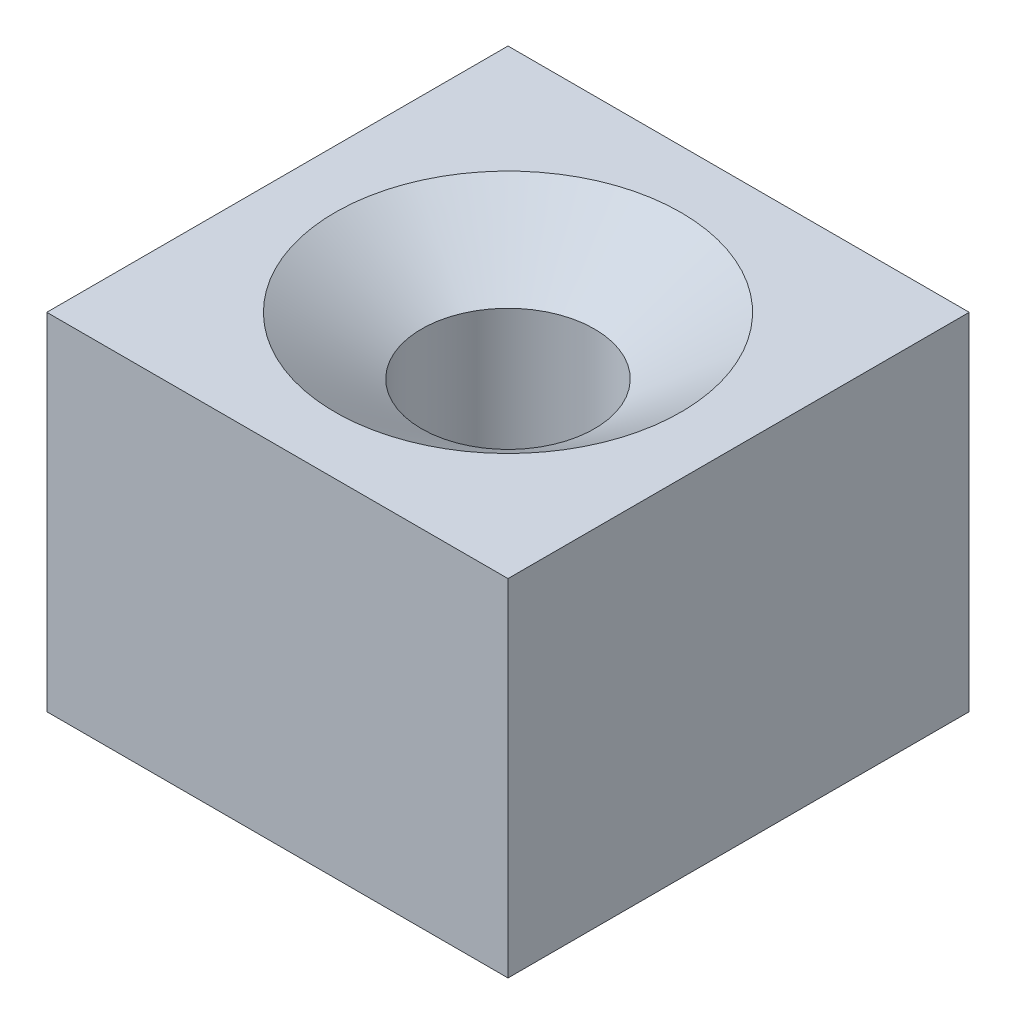
ISO-10303-21;
HEADER;
FILE_DESCRIPTION(('STEP AP214'),'2;1');
FILE_NAME('part.step','',(''),(''),'','','');
FILE_SCHEMA(('AUTOMOTIVE_DESIGN { 1 0 10303 214 1 1 1 1 }'));
ENDSEC;
DATA;
#1=APPLICATION_CONTEXT('core data for automotive mechanical design processes');
#2=APPLICATION_PROTOCOL_DEFINITION('international standard','automotive_design',2000,#1);
#3=PRODUCT_CONTEXT('',#1,'mechanical');
#4=PRODUCT('Part','Part','',(#3));
#5=PRODUCT_RELATED_PRODUCT_CATEGORY('part','',(#4));
#6=PRODUCT_DEFINITION_FORMATION('','',#4);
#7=PRODUCT_DEFINITION_CONTEXT('part definition',#1,'design');
#8=PRODUCT_DEFINITION('design','',#6,#7);
#9=PRODUCT_DEFINITION_SHAPE('','',#8);
#10=(LENGTH_UNIT() NAMED_UNIT(*) SI_UNIT(.MILLI.,.METRE.));
#11=(NAMED_UNIT(*) PLANE_ANGLE_UNIT() SI_UNIT($,.RADIAN.));
#12=(NAMED_UNIT(*) SI_UNIT($,.STERADIAN.) SOLID_ANGLE_UNIT());
#13=UNCERTAINTY_MEASURE_WITH_UNIT(LENGTH_MEASURE(1.E-05),#10,'distance_accuracy_value','');
#14=(GEOMETRIC_REPRESENTATION_CONTEXT(3) GLOBAL_UNCERTAINTY_ASSIGNED_CONTEXT((#13)) GLOBAL_UNIT_ASSIGNED_CONTEXT((#10,
#11,#12)) REPRESENTATION_CONTEXT('',''));
#15=CARTESIAN_POINT('',(0.,0.,0.));
#16=DIRECTION('',(0.,0.,1.));
#17=DIRECTION('',(1.,0.,0.));
#18=AXIS2_PLACEMENT_3D('',#15,#16,#17);
#19=CARTESIAN_POINT('',(40.,60.,40.));
#20=DIRECTION('',(-1.,0.,0.));
#21=DIRECTION('',(0.,0.,1.));
#22=AXIS2_PLACEMENT_3D('',#19,#20,#21);
#23=PLANE('',#22);
#24=DIRECTION('',(0.,0.,-1.));
#25=VECTOR('',#24,1.);
#26=CARTESIAN_POINT('',(40.,0.,40.));
#27=LINE('',#26,#25);
#28=CARTESIAN_POINT('',(40.,0.,40.));
#29=VERTEX_POINT('',#28);
#30=CARTESIAN_POINT('',(40.,0.,-40.));
#31=VERTEX_POINT('',#30);
#32=EDGE_CURVE('E96',#29,#31,#27,.T.);
#33=ORIENTED_EDGE('',*,*,#32,.T.);
#34=DIRECTION('',(0.,-1.,0.));
#35=VECTOR('',#34,1.);
#36=CARTESIAN_POINT('',(40.,60.,-40.));
#37=LINE('',#36,#35);
#38=CARTESIAN_POINT('',(40.,60.,-40.));
#39=VERTEX_POINT('',#38);
#40=EDGE_CURVE('E11',#39,#31,#37,.T.);
#41=ORIENTED_EDGE('',*,*,#40,.F.);
#42=DIRECTION('',(0.,0.,-1.));
#43=VECTOR('',#42,1.);
#44=CARTESIAN_POINT('',(40.,60.,40.));
#45=LINE('',#44,#43);
#46=CARTESIAN_POINT('',(40.,60.,40.));
#47=VERTEX_POINT('',#46);
#48=EDGE_CURVE('E84',#47,#39,#45,.T.);
#49=ORIENTED_EDGE('',*,*,#48,.F.);
#50=DIRECTION('',(0.,-1.,0.));
#51=VECTOR('',#50,1.);
#52=CARTESIAN_POINT('',(40.,60.,40.));
#53=LINE('',#52,#51);
#54=EDGE_CURVE('E92',#47,#29,#53,.T.);
#55=ORIENTED_EDGE('',*,*,#54,.T.);
#56=EDGE_LOOP('',(#33,#41,#49,#55));
#57=FACE_BOUND('',#56,.T.);
#58=ADVANCED_FACE('F33',(#57),#23,.F.);
#59=CARTESIAN_POINT('',(-40.,60.,-40.));
#60=DIRECTION('',(0.,0.,1.));
#61=DIRECTION('',(1.,0.,0.));
#62=AXIS2_PLACEMENT_3D('',#59,#60,#61);
#63=PLANE('',#62);
#64=DIRECTION('',(-1.,0.,0.));
#65=VECTOR('',#64,1.);
#66=CARTESIAN_POINT('',(-40.,0.,-40.));
#67=LINE('',#66,#65);
#68=CARTESIAN_POINT('',(-40.,0.,-40.));
#69=VERTEX_POINT('',#68);
#70=EDGE_CURVE('E88',#31,#69,#67,.T.);
#71=ORIENTED_EDGE('',*,*,#70,.T.);
#72=DIRECTION('',(0.,-1.,0.));
#73=VECTOR('',#72,1.);
#74=CARTESIAN_POINT('',(-40.,60.,-40.));
#75=LINE('',#74,#73);
#76=CARTESIAN_POINT('',(-40.,60.,-40.));
#77=VERTEX_POINT('',#76);
#78=EDGE_CURVE('E41',#77,#69,#75,.T.);
#79=ORIENTED_EDGE('',*,*,#78,.F.);
#80=DIRECTION('',(-1.,0.,0.));
#81=VECTOR('',#80,1.);
#82=CARTESIAN_POINT('',(-40.,60.,-40.));
#83=LINE('',#82,#81);
#84=EDGE_CURVE('E79',#39,#77,#83,.T.);
#85=ORIENTED_EDGE('',*,*,#84,.F.);
#86=ORIENTED_EDGE('',*,*,#40,.T.);
#87=EDGE_LOOP('',(#71,#79,#85,#86));
#88=FACE_BOUND('',#87,.T.);
#89=ADVANCED_FACE('F87',(#88),#63,.F.);
#90=CARTESIAN_POINT('',(-40.,60.,40.));
#91=DIRECTION('',(1.,0.,0.));
#92=DIRECTION('',(0.,0.,-1.));
#93=AXIS2_PLACEMENT_3D('',#90,#91,#92);
#94=PLANE('',#93);
#95=DIRECTION('',(0.,0.,1.));
#96=VECTOR('',#95,1.);
#97=CARTESIAN_POINT('',(-40.,0.,40.));
#98=LINE('',#97,#96);
#99=CARTESIAN_POINT('',(-40.,0.,40.));
#100=VERTEX_POINT('',#99);
#101=EDGE_CURVE('E66',#69,#100,#98,.T.);
#102=ORIENTED_EDGE('',*,*,#101,.T.);
#103=DIRECTION('',(0.,-1.,0.));
#104=VECTOR('',#103,1.);
#105=CARTESIAN_POINT('',(-40.,60.,40.));
#106=LINE('',#105,#104);
#107=CARTESIAN_POINT('',(-40.,60.,40.));
#108=VERTEX_POINT('',#107);
#109=EDGE_CURVE('E89',#108,#100,#106,.T.);
#110=ORIENTED_EDGE('',*,*,#109,.F.);
#111=DIRECTION('',(0.,0.,1.));
#112=VECTOR('',#111,1.);
#113=CARTESIAN_POINT('',(-40.,60.,40.));
#114=LINE('',#113,#112);
#115=EDGE_CURVE('E82',#77,#108,#114,.T.);
#116=ORIENTED_EDGE('',*,*,#115,.F.);
#117=ORIENTED_EDGE('',*,*,#78,.T.);
#118=EDGE_LOOP('',(#102,#110,#116,#117));
#119=FACE_BOUND('',#118,.T.);
#120=ADVANCED_FACE('F90',(#119),#94,.F.);
#121=CARTESIAN_POINT('',(-40.,60.,40.));
#122=DIRECTION('',(0.,0.,-1.));
#123=DIRECTION('',(-1.,0.,0.));
#124=AXIS2_PLACEMENT_3D('',#121,#122,#123);
#125=PLANE('',#124);
#126=DIRECTION('',(1.,0.,0.));
#127=VECTOR('',#126,1.);
#128=CARTESIAN_POINT('',(-40.,0.,40.));
#129=LINE('',#128,#127);
#130=EDGE_CURVE('E72',#100,#29,#129,.T.);
#131=ORIENTED_EDGE('',*,*,#130,.T.);
#132=ORIENTED_EDGE('',*,*,#54,.F.);
#133=DIRECTION('',(1.,0.,0.));
#134=VECTOR('',#133,1.);
#135=CARTESIAN_POINT('',(-40.,60.,40.));
#136=LINE('',#135,#134);
#137=EDGE_CURVE('E49',#108,#47,#136,.T.);
#138=ORIENTED_EDGE('',*,*,#137,.F.);
#139=ORIENTED_EDGE('',*,*,#109,.T.);
#140=EDGE_LOOP('',(#131,#132,#138,#139));
#141=FACE_BOUND('',#140,.T.);
#142=ADVANCED_FACE('F104',(#141),#125,.F.);
#143=CARTESIAN_POINT('',(0.,60.,0.));
#144=DIRECTION('',(0.,-1.,0.));
#145=DIRECTION('',(0.,0.,-1.));
#146=AXIS2_PLACEMENT_3D('',#143,#144,#145);
#147=PLANE('',#146);
#148=CARTESIAN_POINT('',(0.,60.,0.));
#149=DIRECTION('',(0.,-1.,0.));
#150=DIRECTION('',(0.,0.,-1.));
#151=AXIS2_PLACEMENT_3D('',#148,#149,#150);
#152=CIRCLE('',#151,30.);
#153=CARTESIAN_POINT('',(0.,60.,-30.));
#154=VERTEX_POINT('',#153);
#155=EDGE_CURVE('E99',#154,#154,#152,.T.);
#156=ORIENTED_EDGE('',*,*,#155,.T.);
#157=EDGE_LOOP('',(#156));
#158=FACE_BOUND('',#157,.T.);
#159=ORIENTED_EDGE('',*,*,#48,.T.);
#160=ORIENTED_EDGE('',*,*,#84,.T.);
#161=ORIENTED_EDGE('',*,*,#115,.T.);
#162=ORIENTED_EDGE('',*,*,#137,.T.);
#163=EDGE_LOOP('',(#159,#160,#161,#162));
#164=FACE_BOUND('',#163,.T.);
#165=ADVANCED_FACE('F80',(#158,#164),#147,.F.);
#166=CARTESIAN_POINT('',(0.,0.,0.));
#167=DIRECTION('',(0.,-1.,0.));
#168=DIRECTION('',(0.,0.,-1.));
#169=AXIS2_PLACEMENT_3D('',#166,#167,#168);
#170=PLANE('',#169);
#171=ORIENTED_EDGE('',*,*,#32,.F.);
#172=ORIENTED_EDGE('',*,*,#130,.F.);
#173=ORIENTED_EDGE('',*,*,#101,.F.);
#174=ORIENTED_EDGE('',*,*,#70,.F.);
#175=EDGE_LOOP('',(#171,#172,#173,#174));
#176=FACE_BOUND('',#175,.T.);
#177=ADVANCED_FACE('F107',(#176),#170,.T.);
#178=CARTESIAN_POINT('',(0.,60.,0.));
#179=DIRECTION('',(0.,1.,0.));
#180=DIRECTION('',(0.,0.,1.));
#181=AXIS2_PLACEMENT_3D('',#178,#179,#180);
#182=CONICAL_SURFACE('',#181,30.,0.982793723247329);
#183=CARTESIAN_POINT('',(0.,50.,0.));
#184=DIRECTION('',(0.,-1.,0.));
#185=DIRECTION('',(0.,0.,-1.));
#186=AXIS2_PLACEMENT_3D('',#183,#184,#185);
#187=CIRCLE('',#186,15.);
#188=CARTESIAN_POINT('',(0.,50.,-15.));
#189=VERTEX_POINT('',#188);
#190=EDGE_CURVE('E112',#189,#189,#187,.T.);
#191=ORIENTED_EDGE('',*,*,#190,.T.);
#192=EDGE_LOOP('',(#191));
#193=FACE_BOUND('',#192,.T.);
#194=ORIENTED_EDGE('',*,*,#155,.F.);
#195=EDGE_LOOP('',(#194));
#196=FACE_BOUND('',#195,.T.);
#197=ADVANCED_FACE('F128',(#193,#196),#182,.F.);
#198=CARTESIAN_POINT('',(0.,9.99999999999999,0.));
#199=DIRECTION('',(0.,-1.,0.));
#200=DIRECTION('',(0.,0.,-1.));
#201=AXIS2_PLACEMENT_3D('',#198,#199,#200);
#202=CYLINDRICAL_SURFACE('',#201,15.);
#203=CARTESIAN_POINT('',(0.,9.99999999999999,0.));
#204=DIRECTION('',(0.,-1.,0.));
#205=DIRECTION('',(0.,0.,-1.));
#206=AXIS2_PLACEMENT_3D('',#203,#204,#205);
#207=CIRCLE('',#206,15.);
#208=CARTESIAN_POINT('',(0.,9.99999999999999,-15.));
#209=VERTEX_POINT('',#208);
#210=EDGE_CURVE('E115',#209,#209,#207,.T.);
#211=ORIENTED_EDGE('',*,*,#210,.T.);
#212=EDGE_LOOP('',(#211));
#213=FACE_BOUND('',#212,.T.);
#214=ORIENTED_EDGE('',*,*,#190,.F.);
#215=EDGE_LOOP('',(#214));
#216=FACE_BOUND('',#215,.T.);
#217=ADVANCED_FACE('F119',(#213,#216),#202,.F.);
#218=CARTESIAN_POINT('',(-15.,9.99999999999999,0.));
#219=DIRECTION('',(0.,1.,0.));
#220=DIRECTION('',(0.,0.,1.));
#221=AXIS2_PLACEMENT_3D('',#218,#219,#220);
#222=PLANE('',#221);
#223=ORIENTED_EDGE('',*,*,#210,.F.);
#224=EDGE_LOOP('',(#223));
#225=FACE_BOUND('',#224,.T.);
#226=ADVANCED_FACE('F122',(#225),#222,.T.);
#227=CLOSED_SHELL('',(#58,#89,#120,#142,#165,#177,#197,#217,#226));
#228=MANIFOLD_SOLID_BREP('B2',#227);
#229=ADVANCED_BREP_SHAPE_REPRESENTATION('',(#18,#228),#14);
#230=SHAPE_DEFINITION_REPRESENTATION(#9,#229);
ENDSEC;
END-ISO-10303-21;
